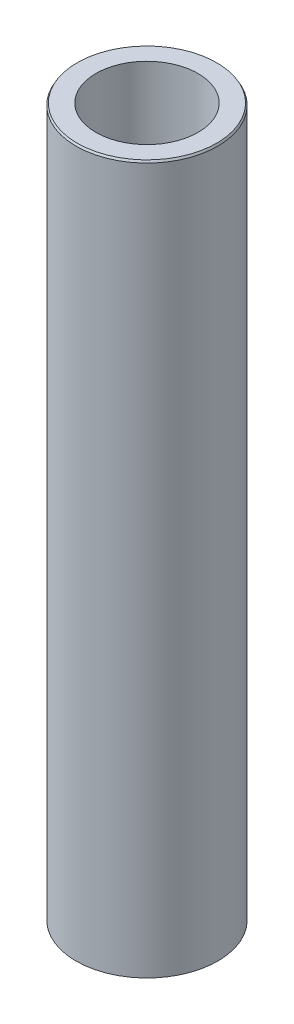
ISO-10303-21;
HEADER;
FILE_DESCRIPTION(('STEP AP214'),'2;1');
FILE_NAME('part.step','',(''),(''),'','','');
FILE_SCHEMA(('AUTOMOTIVE_DESIGN { 1 0 10303 214 1 1 1 1 }'));
ENDSEC;
DATA;
#1=APPLICATION_CONTEXT('core data for automotive mechanical design processes');
#2=APPLICATION_PROTOCOL_DEFINITION('international standard','automotive_design',2000,#1);
#3=PRODUCT_CONTEXT('',#1,'mechanical');
#4=PRODUCT('Part','Part','',(#3));
#5=PRODUCT_RELATED_PRODUCT_CATEGORY('part','',(#4));
#6=PRODUCT_DEFINITION_FORMATION('','',#4);
#7=PRODUCT_DEFINITION_CONTEXT('part definition',#1,'design');
#8=PRODUCT_DEFINITION('design','',#6,#7);
#9=PRODUCT_DEFINITION_SHAPE('','',#8);
#10=(LENGTH_UNIT() NAMED_UNIT(*) SI_UNIT(.MILLI.,.METRE.));
#11=(NAMED_UNIT(*) PLANE_ANGLE_UNIT() SI_UNIT($,.RADIAN.));
#12=(NAMED_UNIT(*) SI_UNIT($,.STERADIAN.) SOLID_ANGLE_UNIT());
#13=UNCERTAINTY_MEASURE_WITH_UNIT(LENGTH_MEASURE(1.E-05),#10,'distance_accuracy_value','');
#14=(GEOMETRIC_REPRESENTATION_CONTEXT(3) GLOBAL_UNCERTAINTY_ASSIGNED_CONTEXT((#13)) GLOBAL_UNIT_ASSIGNED_CONTEXT((#10,
#11,#12)) REPRESENTATION_CONTEXT('',''));
#15=CARTESIAN_POINT('',(0.,0.,0.));
#16=DIRECTION('',(0.,0.,1.));
#17=DIRECTION('',(1.,0.,0.));
#18=AXIS2_PLACEMENT_3D('',#15,#16,#17);
#19=CARTESIAN_POINT('',(0.,600.,0.));
#20=DIRECTION('',(0.,-1.,0.));
#21=DIRECTION('',(0.,0.,-1.));
#22=AXIS2_PLACEMENT_3D('',#19,#20,#21);
#23=CYLINDRICAL_SURFACE('',#22,60.);
#24=CARTESIAN_POINT('',(0.,598.325121994741,0.));
#25=DIRECTION('',(0.,1.,0.));
#26=DIRECTION('',(0.,0.,1.));
#27=AXIS2_PLACEMENT_3D('',#24,#25,#26);
#28=CIRCLE('',#27,60.);
#29=CARTESIAN_POINT('',(0.,598.325121994741,60.));
#30=VERTEX_POINT('',#29);
#31=EDGE_CURVE('E50',#30,#30,#28,.F.);
#32=ORIENTED_EDGE('',*,*,#31,.T.);
#33=EDGE_LOOP('',(#32));
#34=FACE_BOUND('',#33,.T.);
#35=CARTESIAN_POINT('',(0.,0.966991267195572,0.));
#36=DIRECTION('',(0.,1.,0.));
#37=DIRECTION('',(0.,0.,1.));
#38=AXIS2_PLACEMENT_3D('',#35,#36,#37);
#39=CIRCLE('',#38,60.);
#40=CARTESIAN_POINT('',(0.,0.966991267195572,60.));
#41=VERTEX_POINT('',#40);
#42=EDGE_CURVE('E51',#41,#41,#39,.T.);
#43=ORIENTED_EDGE('',*,*,#42,.T.);
#44=EDGE_LOOP('',(#43));
#45=FACE_BOUND('',#44,.T.);
#46=ADVANCED_FACE('F39',(#34,#45),#23,.T.);
#47=CARTESIAN_POINT('',(0.,600.,0.));
#48=DIRECTION('',(0.,1.,0.));
#49=DIRECTION('',(0.,0.,1.));
#50=AXIS2_PLACEMENT_3D('',#47,#48,#49);
#51=PLANE('',#50);
#52=CARTESIAN_POINT('',(0.,600.,0.));
#53=DIRECTION('',(0.,1.,0.));
#54=DIRECTION('',(0.,0.,1.));
#55=AXIS2_PLACEMENT_3D('',#52,#53,#54);
#56=CIRCLE('',#55,59.0330087328042);
#57=CARTESIAN_POINT('',(0.,600.,59.0330087328042));
#58=VERTEX_POINT('',#57);
#59=EDGE_CURVE('E54',#58,#58,#56,.T.);
#60=ORIENTED_EDGE('',*,*,#59,.T.);
#61=EDGE_LOOP('',(#60));
#62=FACE_BOUND('',#61,.T.);
#63=CARTESIAN_POINT('',(0.,600.,0.));
#64=DIRECTION('',(0.,1.,0.));
#65=DIRECTION('',(0.,0.,1.));
#66=AXIS2_PLACEMENT_3D('',#63,#64,#65);
#67=CIRCLE('',#66,43.239378985094);
#68=CARTESIAN_POINT('',(0.,600.,43.239378985094));
#69=VERTEX_POINT('',#68);
#70=EDGE_CURVE('E58',#69,#69,#67,.T.);
#71=ORIENTED_EDGE('',*,*,#70,.F.);
#72=EDGE_LOOP('',(#71));
#73=FACE_BOUND('',#72,.T.);
#74=ADVANCED_FACE('F69',(#62,#73),#51,.T.);
#75=CARTESIAN_POINT('',(0.,0.,0.));
#76=DIRECTION('',(0.,1.,0.));
#77=DIRECTION('',(0.,0.,1.));
#78=AXIS2_PLACEMENT_3D('',#75,#76,#77);
#79=PLANE('',#78);
#80=CARTESIAN_POINT('',(0.,0.,0.));
#81=DIRECTION('',(0.,1.,0.));
#82=DIRECTION('',(0.,0.,1.));
#83=AXIS2_PLACEMENT_3D('',#80,#81,#82);
#84=CIRCLE('',#83,58.3251219947418);
#85=CARTESIAN_POINT('',(0.,0.,58.3251219947418));
#86=VERTEX_POINT('',#85);
#87=EDGE_CURVE('E10',#86,#86,#84,.F.);
#88=ORIENTED_EDGE('',*,*,#87,.T.);
#89=EDGE_LOOP('',(#88));
#90=FACE_BOUND('',#89,.T.);
#91=CARTESIAN_POINT('',(0.,0.,0.));
#92=DIRECTION('',(0.,1.,0.));
#93=DIRECTION('',(0.,0.,1.));
#94=AXIS2_PLACEMENT_3D('',#91,#92,#93);
#95=CIRCLE('',#94,43.239378985094);
#96=CARTESIAN_POINT('',(0.,0.,43.239378985094));
#97=VERTEX_POINT('',#96);
#98=EDGE_CURVE('E63',#97,#97,#95,.T.);
#99=ORIENTED_EDGE('',*,*,#98,.T.);
#100=EDGE_LOOP('',(#99));
#101=FACE_BOUND('',#100,.T.);
#102=ADVANCED_FACE('F75',(#90,#101),#79,.F.);
#103=CARTESIAN_POINT('',(0.,600.,0.));
#104=DIRECTION('',(0.,-1.,0.));
#105=DIRECTION('',(0.,0.,-1.));
#106=AXIS2_PLACEMENT_3D('',#103,#104,#105);
#107=CYLINDRICAL_SURFACE('',#106,43.239378985094);
#108=ORIENTED_EDGE('',*,*,#70,.T.);
#109=EDGE_LOOP('',(#108));
#110=FACE_BOUND('',#109,.T.);
#111=ORIENTED_EDGE('',*,*,#98,.F.);
#112=EDGE_LOOP('',(#111));
#113=FACE_BOUND('',#112,.T.);
#114=ADVANCED_FACE('F70',(#110,#113),#107,.F.);
#115=CARTESIAN_POINT('',(0.,600.,0.));
#116=DIRECTION('',(0.,-1.,0.));
#117=DIRECTION('',(0.,0.,-1.));
#118=AXIS2_PLACEMENT_3D('',#115,#116,#117);
#119=CONICAL_SURFACE('',#118,59.0330087328042,0.52359877559829);
#120=ORIENTED_EDGE('',*,*,#31,.F.);
#121=EDGE_LOOP('',(#120));
#122=FACE_BOUND('',#121,.T.);
#123=ORIENTED_EDGE('',*,*,#59,.F.);
#124=EDGE_LOOP('',(#123));
#125=FACE_BOUND('',#124,.T.);
#126=ADVANCED_FACE('F81',(#122,#125),#119,.T.);
#127=CARTESIAN_POINT('',(0.,0.966991267195572,0.));
#128=DIRECTION('',(0.,1.,0.));
#129=DIRECTION('',(0.,0.,1.));
#130=AXIS2_PLACEMENT_3D('',#127,#128,#129);
#131=CONICAL_SURFACE('',#130,60.,1.04719755119662);
#132=ORIENTED_EDGE('',*,*,#87,.F.);
#133=EDGE_LOOP('',(#132));
#134=FACE_BOUND('',#133,.T.);
#135=ORIENTED_EDGE('',*,*,#42,.F.);
#136=EDGE_LOOP('',(#135));
#137=FACE_BOUND('',#136,.T.);
#138=ADVANCED_FACE('F45',(#134,#137),#131,.T.);
#139=CLOSED_SHELL('',(#46,#74,#102,#114,#126,#138));
#140=MANIFOLD_SOLID_BREP('B2',#139);
#141=ADVANCED_BREP_SHAPE_REPRESENTATION('',(#18,#140),#14);
#142=SHAPE_DEFINITION_REPRESENTATION(#9,#141);
ENDSEC;
END-ISO-10303-21;
